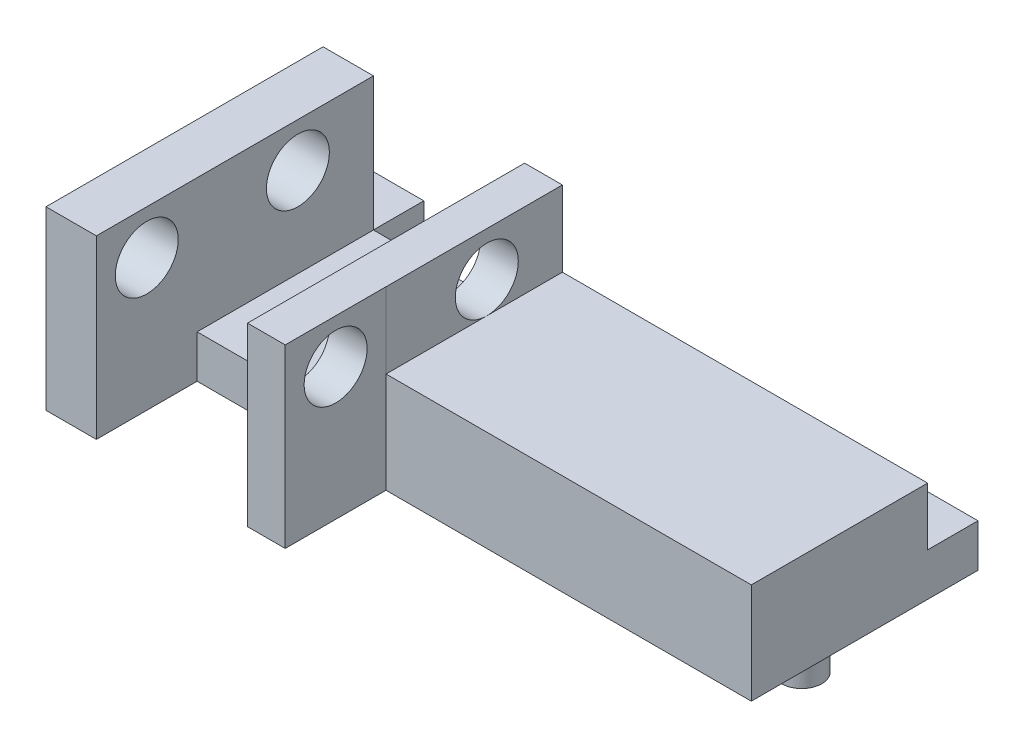
ISO-10303-21;
HEADER;
FILE_DESCRIPTION(('STEP AP214'),'2;1');
FILE_NAME('part.step','',(''),(''),'','','');
FILE_SCHEMA(('AUTOMOTIVE_DESIGN { 1 0 10303 214 1 1 1 1 }'));
ENDSEC;
DATA;
#1=APPLICATION_CONTEXT('core data for automotive mechanical design processes');
#2=APPLICATION_PROTOCOL_DEFINITION('international standard','automotive_design',2000,#1);
#3=PRODUCT_CONTEXT('',#1,'mechanical');
#4=PRODUCT('Part','Part','',(#3));
#5=PRODUCT_RELATED_PRODUCT_CATEGORY('part','',(#4));
#6=PRODUCT_DEFINITION_FORMATION('','',#4);
#7=PRODUCT_DEFINITION_CONTEXT('part definition',#1,'design');
#8=PRODUCT_DEFINITION('design','',#6,#7);
#9=PRODUCT_DEFINITION_SHAPE('','',#8);
#10=(LENGTH_UNIT() NAMED_UNIT(*) SI_UNIT(.MILLI.,.METRE.));
#11=(NAMED_UNIT(*) PLANE_ANGLE_UNIT() SI_UNIT($,.RADIAN.));
#12=(NAMED_UNIT(*) SI_UNIT($,.STERADIAN.) SOLID_ANGLE_UNIT());
#13=UNCERTAINTY_MEASURE_WITH_UNIT(LENGTH_MEASURE(1.E-05),#10,'distance_accuracy_value','');
#14=(GEOMETRIC_REPRESENTATION_CONTEXT(3) GLOBAL_UNCERTAINTY_ASSIGNED_CONTEXT((#13)) GLOBAL_UNIT_ASSIGNED_CONTEXT((#10,
#11,#12)) REPRESENTATION_CONTEXT('',''));
#15=CARTESIAN_POINT('',(0.,0.,0.));
#16=DIRECTION('',(0.,0.,1.));
#17=DIRECTION('',(1.,0.,0.));
#18=AXIS2_PLACEMENT_3D('',#15,#16,#17);
#19=CARTESIAN_POINT('',(0.,4.,-4.));
#20=DIRECTION('',(0.,0.,-1.));
#21=DIRECTION('',(-1.,0.,0.));
#22=AXIS2_PLACEMENT_3D('',#19,#20,#21);
#23=PLANE('',#22);
#24=DIRECTION('',(1.,0.,0.));
#25=VECTOR('',#24,1.);
#26=CARTESIAN_POINT('',(0.,0.,-4.));
#27=LINE('',#26,#25);
#28=CARTESIAN_POINT('',(-23.,0.,-4.));
#29=VERTEX_POINT('',#28);
#30=CARTESIAN_POINT('',(-17.,0.,-4.));
#31=VERTEX_POINT('',#30);
#32=EDGE_CURVE('E67',#29,#31,#27,.T.);
#33=ORIENTED_EDGE('',*,*,#32,.F.);
#34=DIRECTION('',(0.,-1.,0.));
#35=VECTOR('',#34,1.);
#36=CARTESIAN_POINT('',(-23.,0.,-4.));
#37=LINE('',#36,#35);
#38=CARTESIAN_POINT('',(-23.,1.7,-4.));
#39=VERTEX_POINT('',#38);
#40=EDGE_CURVE('E205',#39,#29,#37,.T.);
#41=ORIENTED_EDGE('',*,*,#40,.F.);
#42=DIRECTION('',(-1.,0.,0.));
#43=VECTOR('',#42,1.);
#44=CARTESIAN_POINT('',(0.,1.7,-4.));
#45=LINE('',#44,#43);
#46=CARTESIAN_POINT('',(-17.,1.7,-4.));
#47=VERTEX_POINT('',#46);
#48=EDGE_CURVE('E367',#47,#39,#45,.T.);
#49=ORIENTED_EDGE('',*,*,#48,.F.);
#50=DIRECTION('',(0.,-1.,0.));
#51=VECTOR('',#50,1.);
#52=CARTESIAN_POINT('',(-17.,0.,-4.));
#53=LINE('',#52,#51);
#54=EDGE_CURVE('E11',#47,#31,#53,.T.);
#55=ORIENTED_EDGE('',*,*,#54,.T.);
#56=EDGE_LOOP('',(#33,#41,#49,#55));
#57=FACE_BOUND('',#56,.T.);
#58=ADVANCED_FACE('F41',(#57),#23,.T.);
#59=DIRECTION('',(0.,1.,0.));
#60=VECTOR('',#59,1.);
#61=CARTESIAN_POINT('',(-23.,1.7,-4.));
#62=LINE('',#61,#60);
#63=CARTESIAN_POINT('',(-23.,1.70431443415409,-4.));
#64=VERTEX_POINT('',#63);
#65=CARTESIAN_POINT('',(-23.,7.,-4.));
#66=VERTEX_POINT('',#65);
#67=EDGE_CURVE('E375',#64,#66,#62,.T.);
#68=ORIENTED_EDGE('',*,*,#67,.F.);
#69=DIRECTION('',(1.,0.,0.));
#70=VECTOR('',#69,1.);
#71=CARTESIAN_POINT('',(0.,1.70431443415409,-4.));
#72=LINE('',#71,#70);
#73=CARTESIAN_POINT('',(-25.,1.70431443415409,-4.));
#74=VERTEX_POINT('',#73);
#75=EDGE_CURVE('E201',#74,#64,#72,.T.);
#76=ORIENTED_EDGE('',*,*,#75,.F.);
#77=DIRECTION('',(0.,-1.,0.));
#78=VECTOR('',#77,1.);
#79=CARTESIAN_POINT('',(-25.,4.,-4.));
#80=LINE('',#79,#78);
#81=CARTESIAN_POINT('',(-25.,7.,-4.));
#82=VERTEX_POINT('',#81);
#83=EDGE_CURVE('E424',#82,#74,#80,.T.);
#84=ORIENTED_EDGE('',*,*,#83,.F.);
#85=DIRECTION('',(-1.,0.,0.));
#86=VECTOR('',#85,1.);
#87=CARTESIAN_POINT('',(-23.,7.,-4.));
#88=LINE('',#87,#86);
#89=EDGE_CURVE('E353',#66,#82,#88,.T.);
#90=ORIENTED_EDGE('',*,*,#89,.F.);
#91=EDGE_LOOP('',(#68,#76,#84,#90));
#92=FACE_BOUND('',#91,.T.);
#93=ADVANCED_FACE('F459',(#92),#23,.T.);
#94=CARTESIAN_POINT('',(0.,0.,3.));
#95=DIRECTION('',(0.,0.,-1.));
#96=DIRECTION('',(-1.,0.,0.));
#97=AXIS2_PLACEMENT_3D('',#94,#95,#96);
#98=PLANE('',#97);
#99=DIRECTION('',(0.,-1.,0.));
#100=VECTOR('',#99,1.);
#101=CARTESIAN_POINT('',(-17.,7.,3.));
#102=LINE('',#101,#100);
#103=CARTESIAN_POINT('',(-17.,1.7,3.));
#104=VERTEX_POINT('',#103);
#105=CARTESIAN_POINT('',(-17.,0.,3.));
#106=VERTEX_POINT('',#105);
#107=EDGE_CURVE('E270',#104,#106,#102,.T.);
#108=ORIENTED_EDGE('',*,*,#107,.F.);
#109=DIRECTION('',(1.,0.,0.));
#110=VECTOR('',#109,1.);
#111=CARTESIAN_POINT('',(0.,1.7,3.));
#112=LINE('',#111,#110);
#113=CARTESIAN_POINT('',(-23.,1.7,3.));
#114=VERTEX_POINT('',#113);
#115=EDGE_CURVE('E360',#114,#104,#112,.T.);
#116=ORIENTED_EDGE('',*,*,#115,.F.);
#117=DIRECTION('',(0.,1.,0.));
#118=VECTOR('',#117,1.);
#119=CARTESIAN_POINT('',(-23.,7.,3.));
#120=LINE('',#119,#118);
#121=CARTESIAN_POINT('',(-23.,0.,3.));
#122=VERTEX_POINT('',#121);
#123=EDGE_CURVE('E301',#122,#114,#120,.T.);
#124=ORIENTED_EDGE('',*,*,#123,.F.);
#125=DIRECTION('',(1.,0.,0.));
#126=VECTOR('',#125,1.);
#127=CARTESIAN_POINT('',(-25.,0.,3.));
#128=LINE('',#127,#126);
#129=EDGE_CURVE('E381',#122,#106,#128,.T.);
#130=ORIENTED_EDGE('',*,*,#129,.T.);
#131=EDGE_LOOP('',(#108,#116,#124,#130));
#132=FACE_BOUND('',#131,.T.);
#133=ADVANCED_FACE('F465',(#132),#98,.F.);
#134=DIRECTION('',(0.,1.,0.));
#135=VECTOR('',#134,1.);
#136=CARTESIAN_POINT('',(-15.5025294120522,7.,3.));
#137=LINE('',#136,#135);
#138=CARTESIAN_POINT('',(-15.5025294120522,0.,3.));
#139=VERTEX_POINT('',#138);
#140=CARTESIAN_POINT('',(-15.5025294120522,7.,3.));
#141=VERTEX_POINT('',#140);
#142=EDGE_CURVE('E276',#139,#141,#137,.T.);
#143=ORIENTED_EDGE('',*,*,#142,.F.);
#144=CARTESIAN_POINT('',(-1.,0.,3.));
#145=VERTEX_POINT('',#144);
#146=EDGE_CURVE('E378',#139,#145,#128,.T.);
#147=ORIENTED_EDGE('',*,*,#146,.T.);
#148=DIRECTION('',(0.,1.,0.));
#149=VECTOR('',#148,1.);
#150=CARTESIAN_POINT('',(-1.,0.,3.));
#151=LINE('',#150,#149);
#152=CARTESIAN_POINT('',(-1.,4.,3.));
#153=VERTEX_POINT('',#152);
#154=EDGE_CURVE('E385',#145,#153,#151,.T.);
#155=ORIENTED_EDGE('',*,*,#154,.T.);
#156=DIRECTION('',(-1.,0.,0.));
#157=VECTOR('',#156,1.);
#158=CARTESIAN_POINT('',(-25.,4.,3.));
#159=LINE('',#158,#157);
#160=CARTESIAN_POINT('',(-15.5,4.,3.));
#161=VERTEX_POINT('',#160);
#162=EDGE_CURVE('E389',#153,#161,#159,.T.);
#163=ORIENTED_EDGE('',*,*,#162,.T.);
#164=DIRECTION('',(0.,-1.,0.));
#165=VECTOR('',#164,1.);
#166=CARTESIAN_POINT('',(-15.5,7.,3.));
#167=LINE('',#166,#165);
#168=CARTESIAN_POINT('',(-15.5,7.,3.));
#169=VERTEX_POINT('',#168);
#170=EDGE_CURVE('E346',#169,#161,#167,.T.);
#171=ORIENTED_EDGE('',*,*,#170,.F.);
#172=DIRECTION('',(1.,0.,0.));
#173=VECTOR('',#172,1.);
#174=CARTESIAN_POINT('',(-17.,7.,3.));
#175=LINE('',#174,#173);
#176=EDGE_CURVE('E328',#141,#169,#175,.T.);
#177=ORIENTED_EDGE('',*,*,#176,.F.);
#178=EDGE_LOOP('',(#143,#147,#155,#163,#171,#177));
#179=FACE_BOUND('',#178,.T.);
#180=ADVANCED_FACE('F566',(#179),#98,.F.);
#181=CARTESIAN_POINT('',(0.,4.,0.));
#182=DIRECTION('',(0.,1.,0.));
#183=DIRECTION('',(0.,0.,1.));
#184=AXIS2_PLACEMENT_3D('',#181,#182,#183);
#185=PLANE('',#184);
#186=DIRECTION('',(1.,0.,0.));
#187=VECTOR('',#186,1.);
#188=CARTESIAN_POINT('',(0.,4.,-4.));
#189=LINE('',#188,#187);
#190=CARTESIAN_POINT('',(-15.5,4.,-4.));
#191=VERTEX_POINT('',#190);
#192=CARTESIAN_POINT('',(-1.,4.,-4.));
#193=VERTEX_POINT('',#192);
#194=EDGE_CURVE('E421',#191,#193,#189,.T.);
#195=ORIENTED_EDGE('',*,*,#194,.F.);
#196=DIRECTION('',(0.,0.,-1.));
#197=VECTOR('',#196,1.);
#198=CARTESIAN_POINT('',(-15.5,4.,3.));
#199=LINE('',#198,#197);
#200=CARTESIAN_POINT('',(-15.5,4.,-1.));
#201=VERTEX_POINT('',#200);
#202=EDGE_CURVE('E324',#201,#191,#199,.T.);
#203=ORIENTED_EDGE('',*,*,#202,.F.);
#204=EDGE_CURVE('E329',#161,#201,#199,.T.);
#205=ORIENTED_EDGE('',*,*,#204,.F.);
#206=ORIENTED_EDGE('',*,*,#162,.F.);
#207=DIRECTION('',(0.,0.,-1.));
#208=VECTOR('',#207,1.);
#209=CARTESIAN_POINT('',(-1.,4.,0.));
#210=LINE('',#209,#208);
#211=EDGE_CURVE('E417',#153,#193,#210,.T.);
#212=ORIENTED_EDGE('',*,*,#211,.T.);
#213=EDGE_LOOP('',(#195,#203,#205,#206,#212));
#214=FACE_BOUND('',#213,.T.);
#215=ADVANCED_FACE('F456',(#214),#185,.T.);
#216=DIRECTION('',(1.,0.,0.));
#217=VECTOR('',#216,1.);
#218=CARTESIAN_POINT('',(0.,1.70431443415409,-4.));
#219=LINE('',#218,#217);
#220=CARTESIAN_POINT('',(-17.,1.70431443415409,-4.));
#221=VERTEX_POINT('',#220);
#222=CARTESIAN_POINT('',(-1.,1.70431443415409,-4.));
#223=VERTEX_POINT('',#222);
#224=EDGE_CURVE('E207',#221,#223,#219,.T.);
#225=ORIENTED_EDGE('',*,*,#224,.F.);
#226=DIRECTION('',(0.,1.,0.));
#227=VECTOR('',#226,1.);
#228=CARTESIAN_POINT('',(-17.,1.7,-4.));
#229=LINE('',#228,#227);
#230=CARTESIAN_POINT('',(-17.,7.,-4.));
#231=VERTEX_POINT('',#230);
#232=EDGE_CURVE('E374',#221,#231,#229,.T.);
#233=ORIENTED_EDGE('',*,*,#232,.T.);
#234=DIRECTION('',(-1.,0.,0.));
#235=VECTOR('',#234,1.);
#236=CARTESIAN_POINT('',(-17.,7.,-4.));
#237=LINE('',#236,#235);
#238=CARTESIAN_POINT('',(-15.5,7.,-4.));
#239=VERTEX_POINT('',#238);
#240=EDGE_CURVE('E335',#239,#231,#237,.T.);
#241=ORIENTED_EDGE('',*,*,#240,.F.);
#242=DIRECTION('',(0.,-1.,0.));
#243=VECTOR('',#242,1.);
#244=CARTESIAN_POINT('',(-15.5,7.,-4.));
#245=LINE('',#244,#243);
#246=EDGE_CURVE('E339',#239,#191,#245,.T.);
#247=ORIENTED_EDGE('',*,*,#246,.T.);
#248=ORIENTED_EDGE('',*,*,#194,.T.);
#249=DIRECTION('',(0.,-1.,0.));
#250=VECTOR('',#249,1.);
#251=CARTESIAN_POINT('',(-1.,4.,-4.));
#252=LINE('',#251,#250);
#253=EDGE_CURVE('E435',#193,#223,#252,.T.);
#254=ORIENTED_EDGE('',*,*,#253,.T.);
#255=EDGE_LOOP('',(#225,#233,#241,#247,#248,#254));
#256=FACE_BOUND('',#255,.T.);
#257=ADVANCED_FACE('F448',(#256),#23,.T.);
#258=CARTESIAN_POINT('',(-18.5,-3.,-2.));
#259=DIRECTION('',(0.,1.,0.));
#260=DIRECTION('',(0.,0.,1.));
#261=AXIS2_PLACEMENT_3D('',#258,#259,#260);
#262=CYLINDRICAL_SURFACE('',#261,1.2);
#263=CARTESIAN_POINT('',(-18.5,-3.,-2.));
#264=DIRECTION('',(0.,1.,0.));
#265=DIRECTION('',(0.,0.,1.));
#266=AXIS2_PLACEMENT_3D('',#263,#264,#265);
#267=CIRCLE('',#266,1.2);
#268=CARTESIAN_POINT('',(-18.5,-3.,-0.8));
#269=VERTEX_POINT('',#268);
#270=EDGE_CURVE('E51',#269,#269,#267,.T.);
#271=ORIENTED_EDGE('',*,*,#270,.T.);
#272=EDGE_LOOP('',(#271));
#273=FACE_BOUND('',#272,.T.);
#274=CARTESIAN_POINT('',(-18.5,0.,-2.));
#275=DIRECTION('',(0.,1.,0.));
#276=DIRECTION('',(0.,0.,1.));
#277=AXIS2_PLACEMENT_3D('',#274,#275,#276);
#278=CIRCLE('',#277,1.2);
#279=CARTESIAN_POINT('',(-18.5,0.,-0.8));
#280=VERTEX_POINT('',#279);
#281=EDGE_CURVE('E438',#280,#280,#278,.T.);
#282=ORIENTED_EDGE('',*,*,#281,.F.);
#283=EDGE_LOOP('',(#282));
#284=FACE_BOUND('',#283,.T.);
#285=ADVANCED_FACE('F43',(#273,#284),#262,.T.);
#286=CARTESIAN_POINT('',(0.,-3.,0.));
#287=DIRECTION('',(0.,1.,0.));
#288=DIRECTION('',(0.,0.,1.));
#289=AXIS2_PLACEMENT_3D('',#286,#287,#288);
#290=PLANE('',#289);
#291=ORIENTED_EDGE('',*,*,#270,.F.);
#292=EDGE_LOOP('',(#291));
#293=FACE_BOUND('',#292,.T.);
#294=ADVANCED_FACE('F447',(#293),#290,.F.);
#295=CARTESIAN_POINT('',(-25.,4.,0.));
#296=DIRECTION('',(-1.,0.,0.));
#297=DIRECTION('',(0.,0.,1.));
#298=AXIS2_PLACEMENT_3D('',#295,#296,#297);
#299=PLANE('',#298);
#300=CARTESIAN_POINT('',(-25.,5.25,5.));
#301=DIRECTION('',(1.,0.,0.));
#302=DIRECTION('',(0.,0.,-1.));
#303=AXIS2_PLACEMENT_3D('',#300,#301,#302);
#304=CIRCLE('',#303,1.25);
#305=CARTESIAN_POINT('',(-25.,5.25,3.75));
#306=VERTEX_POINT('',#305);
#307=EDGE_CURVE('E244',#306,#306,#304,.T.);
#308=ORIENTED_EDGE('',*,*,#307,.T.);
#309=EDGE_LOOP('',(#308));
#310=FACE_BOUND('',#309,.T.);
#311=CARTESIAN_POINT('',(-25.,5.25,-1.));
#312=DIRECTION('',(1.,0.,0.));
#313=DIRECTION('',(0.,0.,-1.));
#314=AXIS2_PLACEMENT_3D('',#311,#312,#313);
#315=CIRCLE('',#314,1.25);
#316=CARTESIAN_POINT('',(-25.,5.25,-2.25));
#317=VERTEX_POINT('',#316);
#318=EDGE_CURVE('E248',#317,#317,#315,.T.);
#319=ORIENTED_EDGE('',*,*,#318,.T.);
#320=EDGE_LOOP('',(#319));
#321=FACE_BOUND('',#320,.T.);
#322=DIRECTION('',(0.,0.,-1.));
#323=VECTOR('',#322,1.);
#324=CARTESIAN_POINT('',(-25.,0.,0.));
#325=LINE('',#324,#323);
#326=CARTESIAN_POINT('',(-25.,0.,7.));
#327=VERTEX_POINT('',#326);
#328=CARTESIAN_POINT('',(-25.,0.,-6.));
#329=VERTEX_POINT('',#328);
#330=EDGE_CURVE('E190',#327,#329,#325,.T.);
#331=ORIENTED_EDGE('',*,*,#330,.F.);
#332=DIRECTION('',(0.,-1.,0.));
#333=VECTOR('',#332,1.);
#334=CARTESIAN_POINT('',(-25.,7.,7.));
#335=LINE('',#334,#333);
#336=CARTESIAN_POINT('',(-25.,7.,7.));
#337=VERTEX_POINT('',#336);
#338=EDGE_CURVE('E302',#337,#327,#335,.T.);
#339=ORIENTED_EDGE('',*,*,#338,.F.);
#340=DIRECTION('',(0.,0.,1.));
#341=VECTOR('',#340,1.);
#342=CARTESIAN_POINT('',(-25.,7.,3.));
#343=LINE('',#342,#341);
#344=EDGE_CURVE('E357',#82,#337,#343,.T.);
#345=ORIENTED_EDGE('',*,*,#344,.F.);
#346=ORIENTED_EDGE('',*,*,#83,.T.);
#347=DIRECTION('',(0.,0.,1.));
#348=VECTOR('',#347,1.);
#349=CARTESIAN_POINT('',(-25.,1.70431443415409,-6.));
#350=LINE('',#349,#348);
#351=CARTESIAN_POINT('',(-25.,1.70431443415409,-6.));
#352=VERTEX_POINT('',#351);
#353=EDGE_CURVE('E208',#352,#74,#350,.T.);
#354=ORIENTED_EDGE('',*,*,#353,.F.);
#355=DIRECTION('',(0.,1.,0.));
#356=VECTOR('',#355,1.);
#357=CARTESIAN_POINT('',(-25.,0.,-6.));
#358=LINE('',#357,#356);
#359=EDGE_CURVE('E194',#329,#352,#358,.T.);
#360=ORIENTED_EDGE('',*,*,#359,.F.);
#361=EDGE_LOOP('',(#331,#339,#345,#346,#354,#360));
#362=FACE_BOUND('',#361,.T.);
#363=ADVANCED_FACE('F454',(#310,#321,#362),#299,.T.);
#364=CARTESIAN_POINT('',(-1.,4.,0.));
#365=DIRECTION('',(-1.,0.,0.));
#366=DIRECTION('',(0.,0.,1.));
#367=AXIS2_PLACEMENT_3D('',#364,#365,#366);
#368=PLANE('',#367);
#369=DIRECTION('',(0.,0.,-1.));
#370=VECTOR('',#369,1.);
#371=CARTESIAN_POINT('',(-1.,0.,0.));
#372=LINE('',#371,#370);
#373=CARTESIAN_POINT('',(-1.,0.,-6.));
#374=VERTEX_POINT('',#373);
#375=EDGE_CURVE('E427',#145,#374,#372,.T.);
#376=ORIENTED_EDGE('',*,*,#375,.T.);
#377=DIRECTION('',(0.,-1.,0.));
#378=VECTOR('',#377,1.);
#379=CARTESIAN_POINT('',(-1.,0.,-6.));
#380=LINE('',#379,#378);
#381=CARTESIAN_POINT('',(-1.,1.70431443415409,-6.));
#382=VERTEX_POINT('',#381);
#383=EDGE_CURVE('E224',#382,#374,#380,.T.);
#384=ORIENTED_EDGE('',*,*,#383,.F.);
#385=DIRECTION('',(0.,0.,1.));
#386=VECTOR('',#385,1.);
#387=CARTESIAN_POINT('',(-1.,1.70431443415409,-6.));
#388=LINE('',#387,#386);
#389=EDGE_CURVE('E235',#382,#223,#388,.T.);
#390=ORIENTED_EDGE('',*,*,#389,.T.);
#391=ORIENTED_EDGE('',*,*,#253,.F.);
#392=ORIENTED_EDGE('',*,*,#211,.F.);
#393=ORIENTED_EDGE('',*,*,#154,.F.);
#394=EDGE_LOOP('',(#376,#384,#390,#391,#392,#393));
#395=FACE_BOUND('',#394,.T.);
#396=ADVANCED_FACE('F470',(#395),#368,.F.);
#397=CARTESIAN_POINT('',(0.,0.,0.));
#398=DIRECTION('',(0.,1.,0.));
#399=DIRECTION('',(0.,0.,1.));
#400=AXIS2_PLACEMENT_3D('',#397,#398,#399);
#401=PLANE('',#400);
#402=CARTESIAN_POINT('',(-4.,0.,-2.));
#403=DIRECTION('',(0.,1.,0.));
#404=DIRECTION('',(0.,0.,1.));
#405=AXIS2_PLACEMENT_3D('',#402,#403,#404);
#406=CIRCLE('',#405,0.8);
#407=CARTESIAN_POINT('',(-4.,0.,-1.2));
#408=VERTEX_POINT('',#407);
#409=EDGE_CURVE('E393',#408,#408,#406,.T.);
#410=ORIENTED_EDGE('',*,*,#409,.T.);
#411=EDGE_LOOP('',(#410));
#412=FACE_BOUND('',#411,.T.);
#413=CARTESIAN_POINT('',(-14.,0.,-2.));
#414=DIRECTION('',(0.,1.,0.));
#415=DIRECTION('',(0.,0.,1.));
#416=AXIS2_PLACEMENT_3D('',#413,#414,#415);
#417=CIRCLE('',#416,0.800000000000001);
#418=CARTESIAN_POINT('',(-14.,0.,-1.2));
#419=VERTEX_POINT('',#418);
#420=EDGE_CURVE('E398',#419,#419,#417,.T.);
#421=ORIENTED_EDGE('',*,*,#420,.T.);
#422=EDGE_LOOP('',(#421));
#423=FACE_BOUND('',#422,.T.);
#424=CARTESIAN_POINT('',(-23.,0.,-2.));
#425=DIRECTION('',(0.,1.,0.));
#426=DIRECTION('',(0.,0.,1.));
#427=AXIS2_PLACEMENT_3D('',#424,#425,#426);
#428=CIRCLE('',#427,0.799999999999999);
#429=CARTESIAN_POINT('',(-23.,0.,-1.2));
#430=VERTEX_POINT('',#429);
#431=EDGE_CURVE('E406',#430,#430,#428,.T.);
#432=ORIENTED_EDGE('',*,*,#431,.T.);
#433=EDGE_LOOP('',(#432));
#434=FACE_BOUND('',#433,.T.);
#435=ORIENTED_EDGE('',*,*,#281,.T.);
#436=EDGE_LOOP('',(#435));
#437=FACE_BOUND('',#436,.T.);
#438=ORIENTED_EDGE('',*,*,#330,.T.);
#439=DIRECTION('',(-1.,0.,0.));
#440=VECTOR('',#439,1.);
#441=CARTESIAN_POINT('',(0.,0.,-6.));
#442=LINE('',#441,#440);
#443=CARTESIAN_POINT('',(-23.,0.,-6.));
#444=VERTEX_POINT('',#443);
#445=EDGE_CURVE('E184',#444,#329,#442,.T.);
#446=ORIENTED_EDGE('',*,*,#445,.F.);
#447=DIRECTION('',(0.,0.,1.));
#448=VECTOR('',#447,1.);
#449=CARTESIAN_POINT('',(-23.,0.,-6.));
#450=LINE('',#449,#448);
#451=EDGE_CURVE('E188',#444,#29,#450,.T.);
#452=ORIENTED_EDGE('',*,*,#451,.T.);
#453=ORIENTED_EDGE('',*,*,#32,.T.);
#454=DIRECTION('',(0.,0.,1.));
#455=VECTOR('',#454,1.);
#456=CARTESIAN_POINT('',(-17.,0.,-6.));
#457=LINE('',#456,#455);
#458=CARTESIAN_POINT('',(-17.,0.,-6.));
#459=VERTEX_POINT('',#458);
#460=EDGE_CURVE('E230',#459,#31,#457,.T.);
#461=ORIENTED_EDGE('',*,*,#460,.F.);
#462=DIRECTION('',(-1.,0.,0.));
#463=VECTOR('',#462,1.);
#464=CARTESIAN_POINT('',(0.,0.,-6.));
#465=LINE('',#464,#463);
#466=EDGE_CURVE('E228',#374,#459,#465,.T.);
#467=ORIENTED_EDGE('',*,*,#466,.F.);
#468=ORIENTED_EDGE('',*,*,#375,.F.);
#469=ORIENTED_EDGE('',*,*,#146,.F.);
#470=DIRECTION('',(0.,0.,-1.));
#471=VECTOR('',#470,1.);
#472=CARTESIAN_POINT('',(-15.5025294120522,0.,7.));
#473=LINE('',#472,#471);
#474=CARTESIAN_POINT('',(-15.5025294120522,0.,7.));
#475=VERTEX_POINT('',#474);
#476=EDGE_CURVE('E294',#475,#139,#473,.T.);
#477=ORIENTED_EDGE('',*,*,#476,.F.);
#478=DIRECTION('',(1.,0.,0.));
#479=VECTOR('',#478,1.);
#480=CARTESIAN_POINT('',(-17.,0.,7.));
#481=LINE('',#480,#479);
#482=CARTESIAN_POINT('',(-17.,0.,7.));
#483=VERTEX_POINT('',#482);
#484=EDGE_CURVE('E275',#483,#475,#481,.T.);
#485=ORIENTED_EDGE('',*,*,#484,.F.);
#486=DIRECTION('',(0.,0.,-1.));
#487=VECTOR('',#486,1.);
#488=CARTESIAN_POINT('',(-17.,0.,7.));
#489=LINE('',#488,#487);
#490=EDGE_CURVE('E297',#483,#106,#489,.T.);
#491=ORIENTED_EDGE('',*,*,#490,.T.);
#492=ORIENTED_EDGE('',*,*,#129,.F.);
#493=DIRECTION('',(0.,0.,-1.));
#494=VECTOR('',#493,1.);
#495=CARTESIAN_POINT('',(-23.,0.,7.));
#496=LINE('',#495,#494);
#497=CARTESIAN_POINT('',(-23.,0.,7.));
#498=VERTEX_POINT('',#497);
#499=EDGE_CURVE('E317',#498,#122,#496,.T.);
#500=ORIENTED_EDGE('',*,*,#499,.F.);
#501=DIRECTION('',(1.,0.,0.));
#502=VECTOR('',#501,1.);
#503=CARTESIAN_POINT('',(-25.,0.,7.));
#504=LINE('',#503,#502);
#505=EDGE_CURVE('E306',#327,#498,#504,.T.);
#506=ORIENTED_EDGE('',*,*,#505,.F.);
#507=EDGE_LOOP('',(#438,#446,#452,#453,#461,#467,#468,#469,#477,#485,#491,#492,#500,#506));
#508=FACE_BOUND('',#507,.T.);
#509=ADVANCED_FACE('F186',(#412,#423,#434,#437,#508),#401,.F.);
#510=CARTESIAN_POINT('',(-23.,-3.,-2.));
#511=DIRECTION('',(0.,1.,0.));
#512=DIRECTION('',(0.,0.,1.));
#513=AXIS2_PLACEMENT_3D('',#510,#511,#512);
#514=CYLINDRICAL_SURFACE('',#513,0.799999999999999);
#515=CARTESIAN_POINT('',(-23.,-3.,-2.));
#516=DIRECTION('',(0.,1.,0.));
#517=DIRECTION('',(0.,0.,1.));
#518=AXIS2_PLACEMENT_3D('',#515,#516,#517);
#519=CIRCLE('',#518,0.799999999999999);
#520=CARTESIAN_POINT('',(-23.,-3.,-1.2));
#521=VERTEX_POINT('',#520);
#522=EDGE_CURVE('E410',#521,#521,#519,.T.);
#523=ORIENTED_EDGE('',*,*,#522,.T.);
#524=EDGE_LOOP('',(#523));
#525=FACE_BOUND('',#524,.T.);
#526=ORIENTED_EDGE('',*,*,#431,.F.);
#527=EDGE_LOOP('',(#526));
#528=FACE_BOUND('',#527,.T.);
#529=ADVANCED_FACE('F586',(#525,#528),#514,.T.);
#530=CARTESIAN_POINT('',(0.,-3.,0.));
#531=DIRECTION('',(0.,1.,0.));
#532=DIRECTION('',(0.,0.,1.));
#533=AXIS2_PLACEMENT_3D('',#530,#531,#532);
#534=PLANE('',#533);
#535=ORIENTED_EDGE('',*,*,#522,.F.);
#536=EDGE_LOOP('',(#535));
#537=FACE_BOUND('',#536,.T.);
#538=ADVANCED_FACE('F582',(#537),#534,.F.);
#539=CARTESIAN_POINT('',(-14.,-3.,-2.));
#540=DIRECTION('',(0.,1.,0.));
#541=DIRECTION('',(0.,0.,1.));
#542=AXIS2_PLACEMENT_3D('',#539,#540,#541);
#543=CYLINDRICAL_SURFACE('',#542,0.800000000000001);
#544=CARTESIAN_POINT('',(-14.,-3.,-2.));
#545=DIRECTION('',(0.,1.,0.));
#546=DIRECTION('',(0.,0.,1.));
#547=AXIS2_PLACEMENT_3D('',#544,#545,#546);
#548=CIRCLE('',#547,0.800000000000001);
#549=CARTESIAN_POINT('',(-14.,-3.,-1.2));
#550=VERTEX_POINT('',#549);
#551=EDGE_CURVE('E402',#550,#550,#548,.T.);
#552=ORIENTED_EDGE('',*,*,#551,.T.);
#553=EDGE_LOOP('',(#552));
#554=FACE_BOUND('',#553,.T.);
#555=ORIENTED_EDGE('',*,*,#420,.F.);
#556=EDGE_LOOP('',(#555));
#557=FACE_BOUND('',#556,.T.);
#558=ADVANCED_FACE('F578',(#554,#557),#543,.T.);
#559=CARTESIAN_POINT('',(0.,-3.,0.));
#560=DIRECTION('',(0.,1.,0.));
#561=DIRECTION('',(0.,0.,1.));
#562=AXIS2_PLACEMENT_3D('',#559,#560,#561);
#563=PLANE('',#562);
#564=ORIENTED_EDGE('',*,*,#551,.F.);
#565=EDGE_LOOP('',(#564));
#566=FACE_BOUND('',#565,.T.);
#567=ADVANCED_FACE('F574',(#566),#563,.F.);
#568=CARTESIAN_POINT('',(-4.,-3.,-2.));
#569=DIRECTION('',(0.,1.,0.));
#570=DIRECTION('',(0.,0.,1.));
#571=AXIS2_PLACEMENT_3D('',#568,#569,#570);
#572=CYLINDRICAL_SURFACE('',#571,0.8);
#573=CARTESIAN_POINT('',(-4.,-3.,-2.));
#574=DIRECTION('',(0.,1.,0.));
#575=DIRECTION('',(0.,0.,1.));
#576=AXIS2_PLACEMENT_3D('',#573,#574,#575);
#577=CIRCLE('',#576,0.8);
#578=CARTESIAN_POINT('',(-4.,-3.,-1.2));
#579=VERTEX_POINT('',#578);
#580=EDGE_CURVE('E394',#579,#579,#577,.T.);
#581=ORIENTED_EDGE('',*,*,#580,.T.);
#582=EDGE_LOOP('',(#581));
#583=FACE_BOUND('',#582,.T.);
#584=ORIENTED_EDGE('',*,*,#409,.F.);
#585=EDGE_LOOP('',(#584));
#586=FACE_BOUND('',#585,.T.);
#587=ADVANCED_FACE('F570',(#583,#586),#572,.T.);
#588=CARTESIAN_POINT('',(0.,-3.,0.));
#589=DIRECTION('',(0.,1.,0.));
#590=DIRECTION('',(0.,0.,1.));
#591=AXIS2_PLACEMENT_3D('',#588,#589,#590);
#592=PLANE('',#591);
#593=ORIENTED_EDGE('',*,*,#580,.F.);
#594=EDGE_LOOP('',(#593));
#595=FACE_BOUND('',#594,.T.);
#596=ADVANCED_FACE('F559',(#595),#592,.F.);
#597=CARTESIAN_POINT('',(-23.,1.7,0.));
#598=DIRECTION('',(1.,0.,0.));
#599=DIRECTION('',(0.,0.,-1.));
#600=AXIS2_PLACEMENT_3D('',#597,#598,#599);
#601=PLANE('',#600);
#602=CARTESIAN_POINT('',(-23.,5.25,5.));
#603=DIRECTION('',(1.,0.,0.));
#604=DIRECTION('',(0.,0.,-1.));
#605=AXIS2_PLACEMENT_3D('',#602,#603,#604);
#606=CIRCLE('',#605,1.25);
#607=CARTESIAN_POINT('',(-23.,5.25,3.75));
#608=VERTEX_POINT('',#607);
#609=EDGE_CURVE('E258',#608,#608,#606,.T.);
#610=ORIENTED_EDGE('',*,*,#609,.F.);
#611=EDGE_LOOP('',(#610));
#612=FACE_BOUND('',#611,.T.);
#613=CARTESIAN_POINT('',(-23.,5.25,-1.));
#614=DIRECTION('',(1.,0.,0.));
#615=DIRECTION('',(0.,0.,-1.));
#616=AXIS2_PLACEMENT_3D('',#613,#614,#615);
#617=CIRCLE('',#616,1.25);
#618=CARTESIAN_POINT('',(-23.,5.25,-2.25));
#619=VERTEX_POINT('',#618);
#620=EDGE_CURVE('E266',#619,#619,#617,.T.);
#621=ORIENTED_EDGE('',*,*,#620,.F.);
#622=EDGE_LOOP('',(#621));
#623=FACE_BOUND('',#622,.T.);
#624=DIRECTION('',(0.,0.,-1.));
#625=VECTOR('',#624,1.);
#626=CARTESIAN_POINT('',(-23.,1.7,0.));
#627=LINE('',#626,#625);
#628=EDGE_CURVE('E371',#114,#39,#627,.T.);
#629=ORIENTED_EDGE('',*,*,#628,.T.);
#630=ORIENTED_EDGE('',*,*,#40,.T.);
#631=ORIENTED_EDGE('',*,*,#451,.F.);
#632=DIRECTION('',(0.,-1.,0.));
#633=VECTOR('',#632,1.);
#634=CARTESIAN_POINT('',(-23.,0.,-6.));
#635=LINE('',#634,#633);
#636=CARTESIAN_POINT('',(-23.,1.70431443415409,-6.));
#637=VERTEX_POINT('',#636);
#638=EDGE_CURVE('E195',#637,#444,#635,.T.);
#639=ORIENTED_EDGE('',*,*,#638,.F.);
#640=DIRECTION('',(0.,0.,1.));
#641=VECTOR('',#640,1.);
#642=CARTESIAN_POINT('',(-23.,1.70431443415409,-6.));
#643=LINE('',#642,#641);
#644=EDGE_CURVE('E59',#637,#64,#643,.T.);
#645=ORIENTED_EDGE('',*,*,#644,.T.);
#646=ORIENTED_EDGE('',*,*,#67,.T.);
#647=DIRECTION('',(0.,0.,-1.));
#648=VECTOR('',#647,1.);
#649=CARTESIAN_POINT('',(-23.,7.,3.));
#650=LINE('',#649,#648);
#651=CARTESIAN_POINT('',(-23.,7.,7.));
#652=VERTEX_POINT('',#651);
#653=EDGE_CURVE('E349',#652,#66,#650,.T.);
#654=ORIENTED_EDGE('',*,*,#653,.F.);
#655=DIRECTION('',(0.,1.,0.));
#656=VECTOR('',#655,1.);
#657=CARTESIAN_POINT('',(-23.,7.,7.));
#658=LINE('',#657,#656);
#659=EDGE_CURVE('E309',#498,#652,#658,.T.);
#660=ORIENTED_EDGE('',*,*,#659,.F.);
#661=ORIENTED_EDGE('',*,*,#499,.T.);
#662=ORIENTED_EDGE('',*,*,#123,.T.);
#663=EDGE_LOOP('',(#629,#630,#631,#639,#645,#646,#654,#660,#661,#662));
#664=FACE_BOUND('',#663,.T.);
#665=ADVANCED_FACE('F204',(#612,#623,#664),#601,.T.);
#666=CARTESIAN_POINT('',(-17.,1.7,0.));
#667=DIRECTION('',(1.,0.,0.));
#668=DIRECTION('',(0.,0.,-1.));
#669=AXIS2_PLACEMENT_3D('',#666,#667,#668);
#670=PLANE('',#669);
#671=CARTESIAN_POINT('',(-17.,5.25,5.));
#672=DIRECTION('',(1.,0.,0.));
#673=DIRECTION('',(0.,0.,-1.));
#674=AXIS2_PLACEMENT_3D('',#671,#672,#673);
#675=CIRCLE('',#674,1.25);
#676=CARTESIAN_POINT('',(-17.,5.25,3.75));
#677=VERTEX_POINT('',#676);
#678=EDGE_CURVE('E254',#677,#677,#675,.T.);
#679=ORIENTED_EDGE('',*,*,#678,.T.);
#680=EDGE_LOOP('',(#679));
#681=FACE_BOUND('',#680,.T.);
#682=CARTESIAN_POINT('',(-17.,5.25,-1.));
#683=DIRECTION('',(1.,0.,0.));
#684=DIRECTION('',(0.,0.,-1.));
#685=AXIS2_PLACEMENT_3D('',#682,#683,#684);
#686=CIRCLE('',#685,1.25);
#687=CARTESIAN_POINT('',(-17.,5.25,-2.25));
#688=VERTEX_POINT('',#687);
#689=EDGE_CURVE('E262',#688,#688,#686,.T.);
#690=ORIENTED_EDGE('',*,*,#689,.T.);
#691=EDGE_LOOP('',(#690));
#692=FACE_BOUND('',#691,.T.);
#693=DIRECTION('',(0.,0.,-1.));
#694=VECTOR('',#693,1.);
#695=CARTESIAN_POINT('',(-17.,1.7,0.));
#696=LINE('',#695,#694);
#697=EDGE_CURVE('E364',#104,#47,#696,.T.);
#698=ORIENTED_EDGE('',*,*,#697,.F.);
#699=ORIENTED_EDGE('',*,*,#107,.T.);
#700=ORIENTED_EDGE('',*,*,#490,.F.);
#701=DIRECTION('',(0.,-1.,0.));
#702=VECTOR('',#701,1.);
#703=CARTESIAN_POINT('',(-17.,7.,7.));
#704=LINE('',#703,#702);
#705=CARTESIAN_POINT('',(-17.,7.,7.));
#706=VERTEX_POINT('',#705);
#707=EDGE_CURVE('E271',#706,#483,#704,.T.);
#708=ORIENTED_EDGE('',*,*,#707,.F.);
#709=DIRECTION('',(0.,0.,1.));
#710=VECTOR('',#709,1.);
#711=CARTESIAN_POINT('',(-17.,7.,3.));
#712=LINE('',#711,#710);
#713=EDGE_CURVE('E325',#231,#706,#712,.T.);
#714=ORIENTED_EDGE('',*,*,#713,.F.);
#715=ORIENTED_EDGE('',*,*,#232,.F.);
#716=DIRECTION('',(0.,0.,1.));
#717=VECTOR('',#716,1.);
#718=CARTESIAN_POINT('',(-17.,1.70431443415409,-6.));
#719=LINE('',#718,#717);
#720=CARTESIAN_POINT('',(-17.,1.70431443415409,-6.));
#721=VERTEX_POINT('',#720);
#722=EDGE_CURVE('E239',#721,#221,#719,.T.);
#723=ORIENTED_EDGE('',*,*,#722,.F.);
#724=DIRECTION('',(0.,-1.,0.));
#725=VECTOR('',#724,1.);
#726=CARTESIAN_POINT('',(-17.,0.,-6.));
#727=LINE('',#726,#725);
#728=EDGE_CURVE('E213',#721,#459,#727,.T.);
#729=ORIENTED_EDGE('',*,*,#728,.T.);
#730=ORIENTED_EDGE('',*,*,#460,.T.);
#731=ORIENTED_EDGE('',*,*,#54,.F.);
#732=EDGE_LOOP('',(#698,#699,#700,#708,#714,#715,#723,#729,#730,#731));
#733=FACE_BOUND('',#732,.T.);
#734=ADVANCED_FACE('F555',(#681,#692,#733),#670,.F.);
#735=CARTESIAN_POINT('',(0.,1.7,0.));
#736=DIRECTION('',(0.,1.,0.));
#737=DIRECTION('',(0.,0.,1.));
#738=AXIS2_PLACEMENT_3D('',#735,#736,#737);
#739=PLANE('',#738);
#740=ORIENTED_EDGE('',*,*,#115,.T.);
#741=ORIENTED_EDGE('',*,*,#697,.T.);
#742=ORIENTED_EDGE('',*,*,#48,.T.);
#743=ORIENTED_EDGE('',*,*,#628,.F.);
#744=EDGE_LOOP('',(#740,#741,#742,#743));
#745=FACE_BOUND('',#744,.T.);
#746=ADVANCED_FACE('F552',(#745),#739,.T.);
#747=CARTESIAN_POINT('',(0.,7.,0.));
#748=DIRECTION('',(0.,1.,0.));
#749=DIRECTION('',(0.,0.,1.));
#750=AXIS2_PLACEMENT_3D('',#747,#748,#749);
#751=PLANE('',#750);
#752=ORIENTED_EDGE('',*,*,#653,.T.);
#753=ORIENTED_EDGE('',*,*,#89,.T.);
#754=ORIENTED_EDGE('',*,*,#344,.T.);
#755=DIRECTION('',(-1.,0.,0.));
#756=VECTOR('',#755,1.);
#757=CARTESIAN_POINT('',(-25.,7.,7.));
#758=LINE('',#757,#756);
#759=EDGE_CURVE('E313',#652,#337,#758,.T.);
#760=ORIENTED_EDGE('',*,*,#759,.F.);
#761=EDGE_LOOP('',(#752,#753,#754,#760));
#762=FACE_BOUND('',#761,.T.);
#763=ADVANCED_FACE('F492',(#762),#751,.T.);
#764=CARTESIAN_POINT('',(-15.5,7.,3.));
#765=DIRECTION('',(-1.,0.,0.));
#766=DIRECTION('',(0.,0.,1.));
#767=AXIS2_PLACEMENT_3D('',#764,#765,#766);
#768=PLANE('',#767);
#769=ORIENTED_EDGE('',*,*,#204,.T.);
#770=CARTESIAN_POINT('',(-15.5,5.25,-1.));
#771=DIRECTION('',(1.,0.,0.));
#772=DIRECTION('',(0.,0.,-1.));
#773=AXIS2_PLACEMENT_3D('',#770,#771,#772);
#774=CIRCLE('',#773,1.25);
#775=EDGE_CURVE('E243',#201,#201,#774,.T.);
#776=ORIENTED_EDGE('',*,*,#775,.F.);
#777=ORIENTED_EDGE('',*,*,#202,.T.);
#778=ORIENTED_EDGE('',*,*,#246,.F.);
#779=DIRECTION('',(0.,0.,-1.));
#780=VECTOR('',#779,1.);
#781=CARTESIAN_POINT('',(-15.5,7.,3.));
#782=LINE('',#781,#780);
#783=EDGE_CURVE('E332',#169,#239,#782,.T.);
#784=ORIENTED_EDGE('',*,*,#783,.F.);
#785=ORIENTED_EDGE('',*,*,#170,.T.);
#786=EDGE_LOOP('',(#769,#776,#777,#778,#784,#785));
#787=FACE_BOUND('',#786,.T.);
#788=ADVANCED_FACE('F545',(#787),#768,.F.);
#789=CARTESIAN_POINT('',(0.,7.,0.));
#790=DIRECTION('',(0.,-1.,0.));
#791=DIRECTION('',(0.,0.,-1.));
#792=AXIS2_PLACEMENT_3D('',#789,#790,#791);
#793=PLANE('',#792);
#794=ORIENTED_EDGE('',*,*,#713,.T.);
#795=DIRECTION('',(-1.,0.,0.));
#796=VECTOR('',#795,1.);
#797=CARTESIAN_POINT('',(-17.,7.,7.));
#798=LINE('',#797,#796);
#799=CARTESIAN_POINT('',(-15.5025294120522,7.,7.));
#800=VERTEX_POINT('',#799);
#801=EDGE_CURVE('E282',#800,#706,#798,.T.);
#802=ORIENTED_EDGE('',*,*,#801,.F.);
#803=DIRECTION('',(0.,0.,-1.));
#804=VECTOR('',#803,1.);
#805=CARTESIAN_POINT('',(-15.5025294120522,7.,7.));
#806=LINE('',#805,#804);
#807=EDGE_CURVE('E286',#800,#141,#806,.T.);
#808=ORIENTED_EDGE('',*,*,#807,.T.);
#809=ORIENTED_EDGE('',*,*,#176,.T.);
#810=ORIENTED_EDGE('',*,*,#783,.T.);
#811=ORIENTED_EDGE('',*,*,#240,.T.);
#812=EDGE_LOOP('',(#794,#802,#808,#809,#810,#811));
#813=FACE_BOUND('',#812,.T.);
#814=ADVANCED_FACE('F542',(#813),#793,.F.);
#815=CARTESIAN_POINT('',(0.,0.,7.));
#816=DIRECTION('',(0.,0.,1.));
#817=DIRECTION('',(1.,0.,0.));
#818=AXIS2_PLACEMENT_3D('',#815,#816,#817);
#819=PLANE('',#818);
#820=ORIENTED_EDGE('',*,*,#338,.T.);
#821=ORIENTED_EDGE('',*,*,#505,.T.);
#822=ORIENTED_EDGE('',*,*,#659,.T.);
#823=ORIENTED_EDGE('',*,*,#759,.T.);
#824=EDGE_LOOP('',(#820,#821,#822,#823));
#825=FACE_BOUND('',#824,.T.);
#826=ADVANCED_FACE('F489',(#825),#819,.T.);
#827=CARTESIAN_POINT('',(-15.5025294120522,7.,7.));
#828=DIRECTION('',(-1.,0.,0.));
#829=DIRECTION('',(0.,0.,1.));
#830=AXIS2_PLACEMENT_3D('',#827,#828,#829);
#831=PLANE('',#830);
#832=CARTESIAN_POINT('',(-15.5025294120522,5.25,5.));
#833=DIRECTION('',(-1.,0.,0.));
#834=DIRECTION('',(0.,0.,1.));
#835=AXIS2_PLACEMENT_3D('',#832,#833,#834);
#836=CIRCLE('',#835,1.25);
#837=CARTESIAN_POINT('',(-15.5025294120522,5.25,6.25));
#838=VERTEX_POINT('',#837);
#839=EDGE_CURVE('E45',#838,#838,#836,.T.);
#840=ORIENTED_EDGE('',*,*,#839,.T.);
#841=EDGE_LOOP('',(#840));
#842=FACE_BOUND('',#841,.T.);
#843=ORIENTED_EDGE('',*,*,#142,.T.);
#844=ORIENTED_EDGE('',*,*,#807,.F.);
#845=DIRECTION('',(0.,1.,0.));
#846=VECTOR('',#845,1.);
#847=CARTESIAN_POINT('',(-15.5025294120522,7.,7.));
#848=LINE('',#847,#846);
#849=EDGE_CURVE('E279',#475,#800,#848,.T.);
#850=ORIENTED_EDGE('',*,*,#849,.F.);
#851=ORIENTED_EDGE('',*,*,#476,.T.);
#852=EDGE_LOOP('',(#843,#844,#850,#851));
#853=FACE_BOUND('',#852,.T.);
#854=ADVANCED_FACE('F535',(#842,#853),#831,.F.);
#855=CARTESIAN_POINT('',(0.,0.,7.));
#856=DIRECTION('',(0.,0.,1.));
#857=DIRECTION('',(1.,0.,0.));
#858=AXIS2_PLACEMENT_3D('',#855,#856,#857);
#859=PLANE('',#858);
#860=ORIENTED_EDGE('',*,*,#707,.T.);
#861=ORIENTED_EDGE('',*,*,#484,.T.);
#862=ORIENTED_EDGE('',*,*,#849,.T.);
#863=ORIENTED_EDGE('',*,*,#801,.T.);
#864=EDGE_LOOP('',(#860,#861,#862,#863));
#865=FACE_BOUND('',#864,.T.);
#866=ADVANCED_FACE('F527',(#865),#859,.T.);
#867=CARTESIAN_POINT('',(-25.,5.25,5.));
#868=DIRECTION('',(1.,0.,0.));
#869=DIRECTION('',(0.,0.,-1.));
#870=AXIS2_PLACEMENT_3D('',#867,#868,#869);
#871=CYLINDRICAL_SURFACE('',#870,1.25);
#872=ORIENTED_EDGE('',*,*,#839,.F.);
#873=EDGE_LOOP('',(#872));
#874=FACE_BOUND('',#873,.T.);
#875=ORIENTED_EDGE('',*,*,#678,.F.);
#876=EDGE_LOOP('',(#875));
#877=FACE_BOUND('',#876,.T.);
#878=ADVANCED_FACE('F523',(#874,#877),#871,.F.);
#879=CARTESIAN_POINT('',(-25.,5.25,-1.));
#880=DIRECTION('',(1.,0.,0.));
#881=DIRECTION('',(0.,0.,-1.));
#882=AXIS2_PLACEMENT_3D('',#879,#880,#881);
#883=CYLINDRICAL_SURFACE('',#882,1.25);
#884=ORIENTED_EDGE('',*,*,#775,.T.);
#885=EDGE_LOOP('',(#884));
#886=FACE_BOUND('',#885,.T.);
#887=ORIENTED_EDGE('',*,*,#689,.F.);
#888=EDGE_LOOP('',(#887));
#889=FACE_BOUND('',#888,.T.);
#890=ADVANCED_FACE('F526',(#886,#889),#883,.F.);
#891=ORIENTED_EDGE('',*,*,#620,.T.);
#892=EDGE_LOOP('',(#891));
#893=FACE_BOUND('',#892,.T.);
#894=ORIENTED_EDGE('',*,*,#318,.F.);
#895=EDGE_LOOP('',(#894));
#896=FACE_BOUND('',#895,.T.);
#897=ADVANCED_FACE('F529',(#893,#896),#883,.F.);
#898=ORIENTED_EDGE('',*,*,#609,.T.);
#899=EDGE_LOOP('',(#898));
#900=FACE_BOUND('',#899,.T.);
#901=ORIENTED_EDGE('',*,*,#307,.F.);
#902=EDGE_LOOP('',(#901));
#903=FACE_BOUND('',#902,.T.);
#904=ADVANCED_FACE('F521',(#900,#903),#871,.F.);
#905=CARTESIAN_POINT('',(0.,1.70431443415409,-6.));
#906=DIRECTION('',(0.,-1.,0.));
#907=DIRECTION('',(0.,0.,-1.));
#908=AXIS2_PLACEMENT_3D('',#905,#906,#907);
#909=PLANE('',#908);
#910=ORIENTED_EDGE('',*,*,#224,.T.);
#911=ORIENTED_EDGE('',*,*,#389,.F.);
#912=DIRECTION('',(1.,0.,0.));
#913=VECTOR('',#912,1.);
#914=CARTESIAN_POINT('',(0.,1.70431443415409,-6.));
#915=LINE('',#914,#913);
#916=EDGE_CURVE('E221',#721,#382,#915,.T.);
#917=ORIENTED_EDGE('',*,*,#916,.F.);
#918=ORIENTED_EDGE('',*,*,#722,.T.);
#919=EDGE_LOOP('',(#910,#911,#917,#918));
#920=FACE_BOUND('',#919,.T.);
#921=ADVANCED_FACE('F515',(#920),#909,.F.);
#922=CARTESIAN_POINT('',(0.,0.,-6.));
#923=DIRECTION('',(0.,0.,-1.));
#924=DIRECTION('',(-1.,0.,0.));
#925=AXIS2_PLACEMENT_3D('',#922,#923,#924);
#926=PLANE('',#925);
#927=ORIENTED_EDGE('',*,*,#728,.F.);
#928=ORIENTED_EDGE('',*,*,#916,.T.);
#929=ORIENTED_EDGE('',*,*,#383,.T.);
#930=ORIENTED_EDGE('',*,*,#466,.T.);
#931=EDGE_LOOP('',(#927,#928,#929,#930));
#932=FACE_BOUND('',#931,.T.);
#933=ADVANCED_FACE('F508',(#932),#926,.T.);
#934=CARTESIAN_POINT('',(0.,1.70431443415409,-6.));
#935=DIRECTION('',(0.,-1.,0.));
#936=DIRECTION('',(0.,0.,-1.));
#937=AXIS2_PLACEMENT_3D('',#934,#935,#936);
#938=PLANE('',#937);
#939=ORIENTED_EDGE('',*,*,#75,.T.);
#940=ORIENTED_EDGE('',*,*,#644,.F.);
#941=DIRECTION('',(1.,0.,0.));
#942=VECTOR('',#941,1.);
#943=CARTESIAN_POINT('',(0.,1.70431443415409,-6.));
#944=LINE('',#943,#942);
#945=EDGE_CURVE('E199',#352,#637,#944,.T.);
#946=ORIENTED_EDGE('',*,*,#945,.F.);
#947=ORIENTED_EDGE('',*,*,#353,.T.);
#948=EDGE_LOOP('',(#939,#940,#946,#947));
#949=FACE_BOUND('',#948,.T.);
#950=ADVANCED_FACE('F506',(#949),#938,.F.);
#951=CARTESIAN_POINT('',(0.,0.,-6.));
#952=DIRECTION('',(0.,0.,-1.));
#953=DIRECTION('',(-1.,0.,0.));
#954=AXIS2_PLACEMENT_3D('',#951,#952,#953);
#955=PLANE('',#954);
#956=ORIENTED_EDGE('',*,*,#638,.T.);
#957=ORIENTED_EDGE('',*,*,#445,.T.);
#958=ORIENTED_EDGE('',*,*,#359,.T.);
#959=ORIENTED_EDGE('',*,*,#945,.T.);
#960=EDGE_LOOP('',(#956,#957,#958,#959));
#961=FACE_BOUND('',#960,.T.);
#962=ADVANCED_FACE('F197',(#961),#955,.T.);
#963=CLOSED_SHELL('',(#58,#93,#133,#180,#215,#257,#285,#294,#363,#396,#509,#529,#538,#558,#567,
#587,#596,#665,#734,#746,#763,#788,#814,#826,#854,#866,#878,#890,#897,#904,#921,#933,#950,#962));
#964=MANIFOLD_SOLID_BREP('B2',#963);
#965=ADVANCED_BREP_SHAPE_REPRESENTATION('',(#18,#964),#14);
#966=SHAPE_DEFINITION_REPRESENTATION(#9,#965);
ENDSEC;
END-ISO-10303-21;
